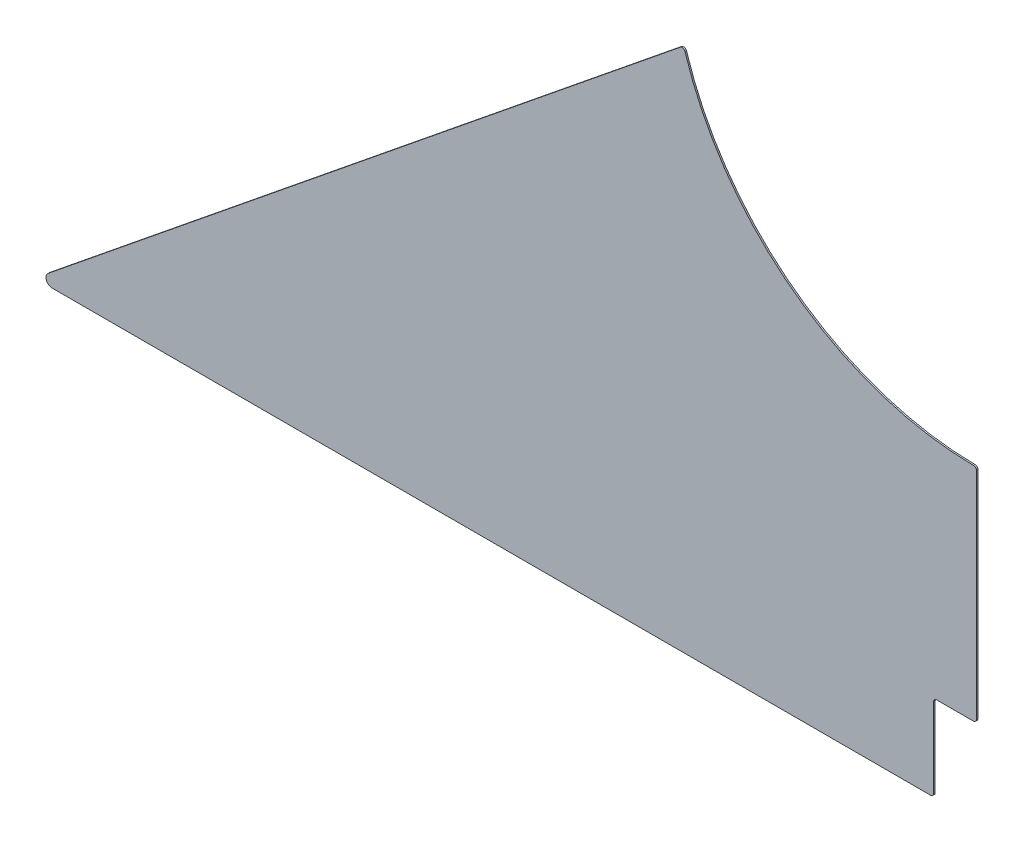
ISO-10303-21;
HEADER;
FILE_DESCRIPTION(('STEP AP214'),'2;1');
FILE_NAME('part.step','',(''),(''),'','','');
FILE_SCHEMA(('AUTOMOTIVE_DESIGN { 1 0 10303 214 1 1 1 1 }'));
ENDSEC;
DATA;
#1=APPLICATION_CONTEXT('core data for automotive mechanical design processes');
#2=APPLICATION_PROTOCOL_DEFINITION('international standard','automotive_design',2000,#1);
#3=PRODUCT_CONTEXT('',#1,'mechanical');
#4=PRODUCT('Part','Part','',(#3));
#5=PRODUCT_RELATED_PRODUCT_CATEGORY('part','',(#4));
#6=PRODUCT_DEFINITION_FORMATION('','',#4);
#7=PRODUCT_DEFINITION_CONTEXT('part definition',#1,'design');
#8=PRODUCT_DEFINITION('design','',#6,#7);
#9=PRODUCT_DEFINITION_SHAPE('','',#8);
#10=(LENGTH_UNIT() NAMED_UNIT(*) SI_UNIT(.MILLI.,.METRE.));
#11=(NAMED_UNIT(*) PLANE_ANGLE_UNIT() SI_UNIT($,.RADIAN.));
#12=(NAMED_UNIT(*) SI_UNIT($,.STERADIAN.) SOLID_ANGLE_UNIT());
#13=UNCERTAINTY_MEASURE_WITH_UNIT(LENGTH_MEASURE(1.E-05),#10,'distance_accuracy_value','');
#14=(GEOMETRIC_REPRESENTATION_CONTEXT(3) GLOBAL_UNCERTAINTY_ASSIGNED_CONTEXT((#13)) GLOBAL_UNIT_ASSIGNED_CONTEXT((#10,
#11,#12)) REPRESENTATION_CONTEXT('',''));
#15=CARTESIAN_POINT('',(0.,0.,0.));
#16=DIRECTION('',(0.,0.,1.));
#17=DIRECTION('',(1.,0.,0.));
#18=AXIS2_PLACEMENT_3D('',#15,#16,#17);
#19=CARTESIAN_POINT('',(-1292.225,-3.17670318081826E-13,1.5875));
#20=DIRECTION('',(0.629320391049834,-0.777145961456974,0.));
#21=DIRECTION('',(0.777145961456974,0.629320391049834,0.));
#22=AXIS2_PLACEMENT_3D('',#19,#20,#21);
#23=PLANE('',#22);
#24=DIRECTION('',(-0.777145961456974,-0.629320391049834,0.));
#25=VECTOR('',#24,1.);
#26=CARTESIAN_POINT('',(-1292.225,-3.17670318081826E-13,0.));
#27=LINE('',#26,#25);
#28=CARTESIAN_POINT('',(-307.961691260842,797.04071187665,0.));
#29=VERTEX_POINT('',#28);
#30=CARTESIAN_POINT('',(-964.74529205127,265.187838692242,0.));
#31=VERTEX_POINT('',#30);
#32=EDGE_CURVE('E201',#29,#31,#27,.T.);
#33=ORIENTED_EDGE('',*,*,#32,.T.);
#34=DIRECTION('',(0.,0.,1.));
#35=VECTOR('',#34,1.);
#36=CARTESIAN_POINT('',(-964.74529205127,265.187838692242,1.5875));
#37=LINE('',#36,#35);
#38=CARTESIAN_POINT('',(-964.74529205127,265.187838692242,1.5875));
#39=VERTEX_POINT('',#38);
#40=EDGE_CURVE('E192',#31,#39,#37,.T.);
#41=ORIENTED_EDGE('',*,*,#40,.T.);
#42=DIRECTION('',(-0.777145961456974,-0.629320391049834,0.));
#43=VECTOR('',#42,1.);
#44=CARTESIAN_POINT('',(-1292.225,-3.17670318081826E-13,1.5875));
#45=LINE('',#44,#43);
#46=CARTESIAN_POINT('',(-307.961691260842,797.04071187665,1.5875));
#47=VERTEX_POINT('',#46);
#48=EDGE_CURVE('E149',#47,#39,#45,.T.);
#49=ORIENTED_EDGE('',*,*,#48,.F.);
#50=DIRECTION('',(0.,0.,-1.));
#51=VECTOR('',#50,1.);
#52=CARTESIAN_POINT('',(-307.961691260842,797.04071187665,1.5875));
#53=LINE('',#52,#51);
#54=EDGE_CURVE('E185',#47,#29,#53,.T.);
#55=ORIENTED_EDGE('',*,*,#54,.T.);
#56=EDGE_LOOP('',(#33,#41,#49,#55));
#57=FACE_BOUND('',#56,.T.);
#58=ADVANCED_FACE('F39',(#57),#23,.F.);
#59=CARTESIAN_POINT('',(0.,890.5875,1.5875));
#60=DIRECTION('',(0.,0.,-1.));
#61=DIRECTION('',(-1.,0.,0.));
#62=AXIS2_PLACEMENT_3D('',#59,#60,#61);
#63=CYLINDRICAL_SURFACE('',#62,317.5);
#64=CARTESIAN_POINT('',(0.,890.5875,1.5875));
#65=DIRECTION('',(0.,0.,-1.));
#66=DIRECTION('',(1.,0.,0.));
#67=AXIS2_PLACEMENT_3D('',#64,#65,#66);
#68=CIRCLE('',#67,317.5);
#69=CARTESIAN_POINT('',(-3.14356435643564,573.103062581192,1.5875));
#70=VERTEX_POINT('',#69);
#71=CARTESIAN_POINT('',(-302.934256454712,795.523909355469,1.5875));
#72=VERTEX_POINT('',#71);
#73=EDGE_CURVE('E131',#70,#72,#68,.T.);
#74=ORIENTED_EDGE('',*,*,#73,.F.);
#75=DIRECTION('',(0.,0.,-1.));
#76=VECTOR('',#75,1.);
#77=CARTESIAN_POINT('',(-3.14356435643564,573.103062581192,1.5875));
#78=LINE('',#77,#76);
#79=CARTESIAN_POINT('',(-3.14356435643564,573.103062581192,0.));
#80=VERTEX_POINT('',#79);
#81=EDGE_CURVE('E145',#70,#80,#78,.T.);
#82=ORIENTED_EDGE('',*,*,#81,.T.);
#83=CARTESIAN_POINT('',(0.,890.5875,0.));
#84=DIRECTION('',(0.,0.,-1.));
#85=DIRECTION('',(1.,0.,0.));
#86=AXIS2_PLACEMENT_3D('',#83,#84,#85);
#87=CIRCLE('',#86,317.5);
#88=CARTESIAN_POINT('',(-302.934256454712,795.523909355469,0.));
#89=VERTEX_POINT('',#88);
#90=EDGE_CURVE('E204',#80,#89,#87,.T.);
#91=ORIENTED_EDGE('',*,*,#90,.T.);
#92=DIRECTION('',(0.,0.,-1.));
#93=VECTOR('',#92,1.);
#94=CARTESIAN_POINT('',(-302.934256454712,795.523909355469,1.5875));
#95=LINE('',#94,#93);
#96=EDGE_CURVE('E148',#89,#72,#95,.F.);
#97=ORIENTED_EDGE('',*,*,#96,.T.);
#98=EDGE_LOOP('',(#74,#82,#91,#97));
#99=FACE_BOUND('',#98,.T.);
#100=ADVANCED_FACE('F143',(#99),#63,.F.);
#101=CARTESIAN_POINT('',(0.,890.5875,1.5875));
#102=DIRECTION('',(0.,0.,1.));
#103=DIRECTION('',(1.,0.,0.));
#104=AXIS2_PLACEMENT_3D('',#101,#102,#103);
#105=PLANE('',#104);
#106=ORIENTED_EDGE('',*,*,#48,.T.);
#107=CARTESIAN_POINT('',(-960.749107568104,260.25296183699,1.5875));
#108=DIRECTION('',(0.,0.,1.));
#109=DIRECTION('',(1.,0.,0.));
#110=AXIS2_PLACEMENT_3D('',#107,#108,#109);
#111=CIRCLE('',#110,6.35);
#112=CARTESIAN_POINT('',(-960.749107568104,253.90296183699,1.5875));
#113=VERTEX_POINT('',#112);
#114=EDGE_CURVE('E61',#39,#113,#111,.T.);
#115=ORIENTED_EDGE('',*,*,#114,.T.);
#116=DIRECTION('',(-1.,0.,0.));
#117=VECTOR('',#116,1.);
#118=CARTESIAN_POINT('',(-44.45,253.902961836991,1.5875));
#119=LINE('',#118,#117);
#120=CARTESIAN_POINT('',(-47.625,253.902961836991,1.5875));
#121=VERTEX_POINT('',#120);
#122=EDGE_CURVE('E233',#121,#113,#119,.T.);
#123=ORIENTED_EDGE('',*,*,#122,.F.);
#124=CARTESIAN_POINT('',(-47.625,257.077961836991,1.5875));
#125=DIRECTION('',(0.,0.,1.));
#126=DIRECTION('',(1.,0.,0.));
#127=AXIS2_PLACEMENT_3D('',#124,#125,#126);
#128=CIRCLE('',#127,3.175);
#129=CARTESIAN_POINT('',(-44.45,257.077961836991,1.5875));
#130=VERTEX_POINT('',#129);
#131=EDGE_CURVE('E170',#121,#130,#128,.T.);
#132=ORIENTED_EDGE('',*,*,#131,.T.);
#133=DIRECTION('',(0.,-1.,0.));
#134=VECTOR('',#133,1.);
#135=CARTESIAN_POINT('',(-44.4499999999999,-3.33066907387547E-13,1.5875));
#136=LINE('',#135,#134);
#137=CARTESIAN_POINT('',(-44.45,339.725,1.5875));
#138=VERTEX_POINT('',#137);
#139=EDGE_CURVE('E220',#138,#130,#136,.T.);
#140=ORIENTED_EDGE('',*,*,#139,.F.);
#141=CARTESIAN_POINT('',(-41.275,339.725,1.5875));
#142=DIRECTION('',(0.,0.,1.));
#143=DIRECTION('',(1.,0.,0.));
#144=AXIS2_PLACEMENT_3D('',#141,#142,#143);
#145=CIRCLE('',#144,3.175);
#146=CARTESIAN_POINT('',(-41.275,342.9,1.5875));
#147=VERTEX_POINT('',#146);
#148=EDGE_CURVE('E188',#138,#147,#145,.F.);
#149=ORIENTED_EDGE('',*,*,#148,.T.);
#150=DIRECTION('',(-1.,0.,0.));
#151=VECTOR('',#150,1.);
#152=CARTESIAN_POINT('',(-44.45,342.9,1.5875));
#153=LINE('',#152,#151);
#154=CARTESIAN_POINT('',(-3.175,342.9,1.5875));
#155=VERTEX_POINT('',#154);
#156=EDGE_CURVE('E207',#155,#147,#153,.T.);
#157=ORIENTED_EDGE('',*,*,#156,.F.);
#158=CARTESIAN_POINT('',(-3.175,346.075,1.5875));
#159=DIRECTION('',(0.,0.,1.));
#160=DIRECTION('',(1.,0.,0.));
#161=AXIS2_PLACEMENT_3D('',#158,#159,#160);
#162=CIRCLE('',#161,3.175);
#163=CARTESIAN_POINT('',(0.,346.075,1.5875));
#164=VERTEX_POINT('',#163);
#165=EDGE_CURVE('E139',#155,#164,#162,.T.);
#166=ORIENTED_EDGE('',*,*,#165,.T.);
#167=DIRECTION('',(0.,-1.,0.));
#168=VECTOR('',#167,1.);
#169=CARTESIAN_POINT('',(0.,0.,1.5875));
#170=LINE('',#169,#168);
#171=CARTESIAN_POINT('',(0.,569.928218207004,1.5875));
#172=VERTEX_POINT('',#171);
#173=EDGE_CURVE('E134',#172,#164,#170,.T.);
#174=ORIENTED_EDGE('',*,*,#173,.F.);
#175=CARTESIAN_POINT('',(-3.175,569.928218207004,1.5875));
#176=DIRECTION('',(0.,0.,1.));
#177=DIRECTION('',(1.,0.,0.));
#178=AXIS2_PLACEMENT_3D('',#175,#176,#177);
#179=CIRCLE('',#178,3.175);
#180=EDGE_CURVE('E128',#172,#70,#179,.T.);
#181=ORIENTED_EDGE('',*,*,#180,.T.);
#182=ORIENTED_EDGE('',*,*,#73,.T.);
#183=CARTESIAN_POINT('',(-305.963599019259,794.573273449024,1.5875));
#184=DIRECTION('',(0.,0.,1.));
#185=DIRECTION('',(1.,0.,0.));
#186=AXIS2_PLACEMENT_3D('',#183,#184,#185);
#187=CIRCLE('',#186,3.175);
#188=EDGE_CURVE('E168',#72,#47,#187,.T.);
#189=ORIENTED_EDGE('',*,*,#188,.T.);
#190=EDGE_LOOP('',(#106,#115,#123,#132,#140,#149,#157,#166,#174,#181,#182,#189));
#191=FACE_BOUND('',#190,.T.);
#192=ADVANCED_FACE('F130',(#191),#105,.T.);
#193=CARTESIAN_POINT('',(0.,890.5875,0.));
#194=DIRECTION('',(0.,0.,1.));
#195=DIRECTION('',(1.,0.,0.));
#196=AXIS2_PLACEMENT_3D('',#193,#194,#195);
#197=PLANE('',#196);
#198=DIRECTION('',(-1.,0.,0.));
#199=VECTOR('',#198,1.);
#200=CARTESIAN_POINT('',(-44.45,253.902961836991,0.));
#201=LINE('',#200,#199);
#202=CARTESIAN_POINT('',(-47.625,253.902961836991,0.));
#203=VERTEX_POINT('',#202);
#204=CARTESIAN_POINT('',(-960.749107568104,253.90296183699,0.));
#205=VERTEX_POINT('',#204);
#206=EDGE_CURVE('E231',#203,#205,#201,.T.);
#207=ORIENTED_EDGE('',*,*,#206,.T.);
#208=CARTESIAN_POINT('',(-960.749107568104,260.25296183699,0.));
#209=DIRECTION('',(0.,0.,1.));
#210=DIRECTION('',(1.,0.,0.));
#211=AXIS2_PLACEMENT_3D('',#208,#209,#210);
#212=CIRCLE('',#211,6.35);
#213=EDGE_CURVE('E11',#205,#31,#212,.F.);
#214=ORIENTED_EDGE('',*,*,#213,.T.);
#215=ORIENTED_EDGE('',*,*,#32,.F.);
#216=CARTESIAN_POINT('',(-305.963599019259,794.573273449024,0.));
#217=DIRECTION('',(0.,0.,1.));
#218=DIRECTION('',(1.,0.,0.));
#219=AXIS2_PLACEMENT_3D('',#216,#217,#218);
#220=CIRCLE('',#219,3.175);
#221=EDGE_CURVE('E153',#29,#89,#220,.F.);
#222=ORIENTED_EDGE('',*,*,#221,.T.);
#223=ORIENTED_EDGE('',*,*,#90,.F.);
#224=CARTESIAN_POINT('',(-3.175,569.928218207004,0.));
#225=DIRECTION('',(0.,0.,1.));
#226=DIRECTION('',(1.,0.,0.));
#227=AXIS2_PLACEMENT_3D('',#224,#225,#226);
#228=CIRCLE('',#227,3.175);
#229=CARTESIAN_POINT('',(0.,569.928218207004,0.));
#230=VERTEX_POINT('',#229);
#231=EDGE_CURVE('E152',#80,#230,#228,.F.);
#232=ORIENTED_EDGE('',*,*,#231,.T.);
#233=DIRECTION('',(0.,-1.,0.));
#234=VECTOR('',#233,1.);
#235=CARTESIAN_POINT('',(0.,0.,0.));
#236=LINE('',#235,#234);
#237=CARTESIAN_POINT('',(0.,346.075,0.));
#238=VERTEX_POINT('',#237);
#239=EDGE_CURVE('E222',#230,#238,#236,.T.);
#240=ORIENTED_EDGE('',*,*,#239,.T.);
#241=CARTESIAN_POINT('',(-3.175,346.075,0.));
#242=DIRECTION('',(0.,0.,1.));
#243=DIRECTION('',(1.,0.,0.));
#244=AXIS2_PLACEMENT_3D('',#241,#242,#243);
#245=CIRCLE('',#244,3.175);
#246=CARTESIAN_POINT('',(-3.175,342.9,0.));
#247=VERTEX_POINT('',#246);
#248=EDGE_CURVE('E161',#238,#247,#245,.F.);
#249=ORIENTED_EDGE('',*,*,#248,.T.);
#250=DIRECTION('',(-1.,0.,0.));
#251=VECTOR('',#250,1.);
#252=CARTESIAN_POINT('',(-44.45,342.9,0.));
#253=LINE('',#252,#251);
#254=CARTESIAN_POINT('',(-41.275,342.9,0.));
#255=VERTEX_POINT('',#254);
#256=EDGE_CURVE('E210',#247,#255,#253,.T.);
#257=ORIENTED_EDGE('',*,*,#256,.T.);
#258=CARTESIAN_POINT('',(-41.275,339.725,0.));
#259=DIRECTION('',(0.,0.,1.));
#260=DIRECTION('',(1.,0.,0.));
#261=AXIS2_PLACEMENT_3D('',#258,#259,#260);
#262=CIRCLE('',#261,3.175);
#263=CARTESIAN_POINT('',(-44.45,339.725,0.));
#264=VERTEX_POINT('',#263);
#265=EDGE_CURVE('E190',#255,#264,#262,.T.);
#266=ORIENTED_EDGE('',*,*,#265,.T.);
#267=DIRECTION('',(0.,-1.,0.));
#268=VECTOR('',#267,1.);
#269=CARTESIAN_POINT('',(-44.4499999999999,-3.33066907387547E-13,0.));
#270=LINE('',#269,#268);
#271=CARTESIAN_POINT('',(-44.45,257.077961836991,0.));
#272=VERTEX_POINT('',#271);
#273=EDGE_CURVE('E212',#264,#272,#270,.T.);
#274=ORIENTED_EDGE('',*,*,#273,.T.);
#275=CARTESIAN_POINT('',(-47.625,257.077961836991,0.));
#276=DIRECTION('',(0.,0.,1.));
#277=DIRECTION('',(1.,0.,0.));
#278=AXIS2_PLACEMENT_3D('',#275,#276,#277);
#279=CIRCLE('',#278,3.175);
#280=EDGE_CURVE('E155',#272,#203,#279,.F.);
#281=ORIENTED_EDGE('',*,*,#280,.T.);
#282=EDGE_LOOP('',(#207,#214,#215,#222,#223,#232,#240,#249,#257,#266,#274,#281));
#283=FACE_BOUND('',#282,.T.);
#284=ADVANCED_FACE('F235',(#283),#197,.F.);
#285=CARTESIAN_POINT('',(-44.4499999999999,-3.33066907387547E-13,0.));
#286=DIRECTION('',(-1.,0.,0.));
#287=DIRECTION('',(0.,-1.,0.));
#288=AXIS2_PLACEMENT_3D('',#285,#286,#287);
#289=PLANE('',#288);
#290=ORIENTED_EDGE('',*,*,#273,.F.);
#291=DIRECTION('',(0.,0.,1.));
#292=VECTOR('',#291,1.);
#293=CARTESIAN_POINT('',(-44.45,339.725,1.5875));
#294=LINE('',#293,#292);
#295=EDGE_CURVE('E174',#264,#138,#294,.T.);
#296=ORIENTED_EDGE('',*,*,#295,.T.);
#297=ORIENTED_EDGE('',*,*,#139,.T.);
#298=DIRECTION('',(0.,0.,1.));
#299=VECTOR('',#298,1.);
#300=CARTESIAN_POINT('',(-44.45,257.077961836991,0.));
#301=LINE('',#300,#299);
#302=EDGE_CURVE('E138',#130,#272,#301,.F.);
#303=ORIENTED_EDGE('',*,*,#302,.T.);
#304=EDGE_LOOP('',(#290,#296,#297,#303));
#305=FACE_BOUND('',#304,.T.);
#306=ADVANCED_FACE('F275',(#305),#289,.F.);
#307=CARTESIAN_POINT('',(-44.45,342.9,0.));
#308=DIRECTION('',(0.,1.,0.));
#309=DIRECTION('',(0.,0.,1.));
#310=AXIS2_PLACEMENT_3D('',#307,#308,#309);
#311=PLANE('',#310);
#312=ORIENTED_EDGE('',*,*,#156,.T.);
#313=DIRECTION('',(0.,0.,1.));
#314=VECTOR('',#313,1.);
#315=CARTESIAN_POINT('',(-41.275,342.9,0.));
#316=LINE('',#315,#314);
#317=EDGE_CURVE('E180',#147,#255,#316,.F.);
#318=ORIENTED_EDGE('',*,*,#317,.T.);
#319=ORIENTED_EDGE('',*,*,#256,.F.);
#320=DIRECTION('',(0.,0.,1.));
#321=VECTOR('',#320,1.);
#322=CARTESIAN_POINT('',(-3.175,342.9,0.));
#323=LINE('',#322,#321);
#324=EDGE_CURVE('E177',#247,#155,#323,.T.);
#325=ORIENTED_EDGE('',*,*,#324,.T.);
#326=EDGE_LOOP('',(#312,#318,#319,#325));
#327=FACE_BOUND('',#326,.T.);
#328=ADVANCED_FACE('F272',(#327),#311,.F.);
#329=CARTESIAN_POINT('',(0.,0.,0.));
#330=DIRECTION('',(-1.,0.,0.));
#331=DIRECTION('',(0.,0.,1.));
#332=AXIS2_PLACEMENT_3D('',#329,#330,#331);
#333=PLANE('',#332);
#334=ORIENTED_EDGE('',*,*,#239,.F.);
#335=DIRECTION('',(0.,0.,-1.));
#336=VECTOR('',#335,1.);
#337=CARTESIAN_POINT('',(0.,569.928218207004,0.));
#338=LINE('',#337,#336);
#339=EDGE_CURVE('E166',#230,#172,#338,.F.);
#340=ORIENTED_EDGE('',*,*,#339,.T.);
#341=ORIENTED_EDGE('',*,*,#173,.T.);
#342=DIRECTION('',(0.,0.,1.));
#343=VECTOR('',#342,1.);
#344=CARTESIAN_POINT('',(0.,346.075,0.));
#345=LINE('',#344,#343);
#346=EDGE_CURVE('E164',#164,#238,#345,.F.);
#347=ORIENTED_EDGE('',*,*,#346,.T.);
#348=EDGE_LOOP('',(#334,#340,#341,#347));
#349=FACE_BOUND('',#348,.T.);
#350=ADVANCED_FACE('F282',(#349),#333,.F.);
#351=CARTESIAN_POINT('',(-44.45,253.902961836991,0.));
#352=DIRECTION('',(0.,1.,0.));
#353=DIRECTION('',(-1.,0.,0.));
#354=AXIS2_PLACEMENT_3D('',#351,#352,#353);
#355=PLANE('',#354);
#356=ORIENTED_EDGE('',*,*,#122,.T.);
#357=DIRECTION('',(0.,0.,1.));
#358=VECTOR('',#357,1.);
#359=CARTESIAN_POINT('',(-960.749107568104,253.90296183699,0.));
#360=LINE('',#359,#358);
#361=EDGE_CURVE('E47',#113,#205,#360,.F.);
#362=ORIENTED_EDGE('',*,*,#361,.T.);
#363=ORIENTED_EDGE('',*,*,#206,.F.);
#364=DIRECTION('',(0.,0.,1.));
#365=VECTOR('',#364,1.);
#366=CARTESIAN_POINT('',(-47.625,253.902961836991,0.));
#367=LINE('',#366,#365);
#368=EDGE_CURVE('E182',#203,#121,#367,.T.);
#369=ORIENTED_EDGE('',*,*,#368,.T.);
#370=EDGE_LOOP('',(#356,#362,#363,#369));
#371=FACE_BOUND('',#370,.T.);
#372=ADVANCED_FACE('F256',(#371),#355,.F.);
#373=CARTESIAN_POINT('',(-3.175,569.928218207004,1.5875));
#374=DIRECTION('',(0.,0.,-1.));
#375=DIRECTION('',(-1.,0.,0.));
#376=AXIS2_PLACEMENT_3D('',#373,#374,#375);
#377=CYLINDRICAL_SURFACE('',#376,3.175);
#378=ORIENTED_EDGE('',*,*,#180,.F.);
#379=ORIENTED_EDGE('',*,*,#339,.F.);
#380=ORIENTED_EDGE('',*,*,#231,.F.);
#381=ORIENTED_EDGE('',*,*,#81,.F.);
#382=EDGE_LOOP('',(#378,#379,#380,#381));
#383=FACE_BOUND('',#382,.T.);
#384=ADVANCED_FACE('F151',(#383),#377,.T.);
#385=CARTESIAN_POINT('',(-41.275,339.725,0.));
#386=DIRECTION('',(0.,0.,-1.));
#387=DIRECTION('',(-1.,0.,0.));
#388=AXIS2_PLACEMENT_3D('',#385,#386,#387);
#389=CYLINDRICAL_SURFACE('',#388,3.175);
#390=ORIENTED_EDGE('',*,*,#265,.F.);
#391=ORIENTED_EDGE('',*,*,#317,.F.);
#392=ORIENTED_EDGE('',*,*,#148,.F.);
#393=ORIENTED_EDGE('',*,*,#295,.F.);
#394=EDGE_LOOP('',(#390,#391,#392,#393));
#395=FACE_BOUND('',#394,.T.);
#396=ADVANCED_FACE('F255',(#395),#389,.F.);
#397=CARTESIAN_POINT('',(-3.175,346.075,0.));
#398=DIRECTION('',(0.,0.,1.));
#399=DIRECTION('',(1.,0.,0.));
#400=AXIS2_PLACEMENT_3D('',#397,#398,#399);
#401=CYLINDRICAL_SURFACE('',#400,3.175);
#402=ORIENTED_EDGE('',*,*,#248,.F.);
#403=ORIENTED_EDGE('',*,*,#346,.F.);
#404=ORIENTED_EDGE('',*,*,#165,.F.);
#405=ORIENTED_EDGE('',*,*,#324,.F.);
#406=EDGE_LOOP('',(#402,#403,#404,#405));
#407=FACE_BOUND('',#406,.T.);
#408=ADVANCED_FACE('F259',(#407),#401,.T.);
#409=CARTESIAN_POINT('',(-47.625,257.077961836991,0.));
#410=DIRECTION('',(0.,0.,1.));
#411=DIRECTION('',(1.,0.,0.));
#412=AXIS2_PLACEMENT_3D('',#409,#410,#411);
#413=CYLINDRICAL_SURFACE('',#412,3.175);
#414=ORIENTED_EDGE('',*,*,#280,.F.);
#415=ORIENTED_EDGE('',*,*,#302,.F.);
#416=ORIENTED_EDGE('',*,*,#131,.F.);
#417=ORIENTED_EDGE('',*,*,#368,.F.);
#418=EDGE_LOOP('',(#414,#415,#416,#417));
#419=FACE_BOUND('',#418,.T.);
#420=ADVANCED_FACE('F243',(#419),#413,.T.);
#421=CARTESIAN_POINT('',(-305.963599019259,794.573273449024,1.5875));
#422=DIRECTION('',(0.,0.,-1.));
#423=DIRECTION('',(-1.,0.,0.));
#424=AXIS2_PLACEMENT_3D('',#421,#422,#423);
#425=CYLINDRICAL_SURFACE('',#424,3.175);
#426=ORIENTED_EDGE('',*,*,#188,.F.);
#427=ORIENTED_EDGE('',*,*,#96,.F.);
#428=ORIENTED_EDGE('',*,*,#221,.F.);
#429=ORIENTED_EDGE('',*,*,#54,.F.);
#430=EDGE_LOOP('',(#426,#427,#428,#429));
#431=FACE_BOUND('',#430,.T.);
#432=ADVANCED_FACE('F239',(#431),#425,.T.);
#433=CARTESIAN_POINT('',(-960.749107568104,260.25296183699,1.5875));
#434=DIRECTION('',(0.,0.,1.));
#435=DIRECTION('',(1.,0.,0.));
#436=AXIS2_PLACEMENT_3D('',#433,#434,#435);
#437=CYLINDRICAL_SURFACE('',#436,6.35);
#438=ORIENTED_EDGE('',*,*,#213,.F.);
#439=ORIENTED_EDGE('',*,*,#361,.F.);
#440=ORIENTED_EDGE('',*,*,#114,.F.);
#441=ORIENTED_EDGE('',*,*,#40,.F.);
#442=EDGE_LOOP('',(#438,#439,#440,#441));
#443=FACE_BOUND('',#442,.T.);
#444=ADVANCED_FACE('F41',(#443),#437,.T.);
#445=CLOSED_SHELL('',(#58,#100,#192,#284,#306,#328,#350,#372,#384,#396,#408,#420,#432,#444));
#446=MANIFOLD_SOLID_BREP('B2',#445);
#447=ADVANCED_BREP_SHAPE_REPRESENTATION('',(#18,#446),#14);
#448=SHAPE_DEFINITION_REPRESENTATION(#9,#447);
ENDSEC;
END-ISO-10303-21;
